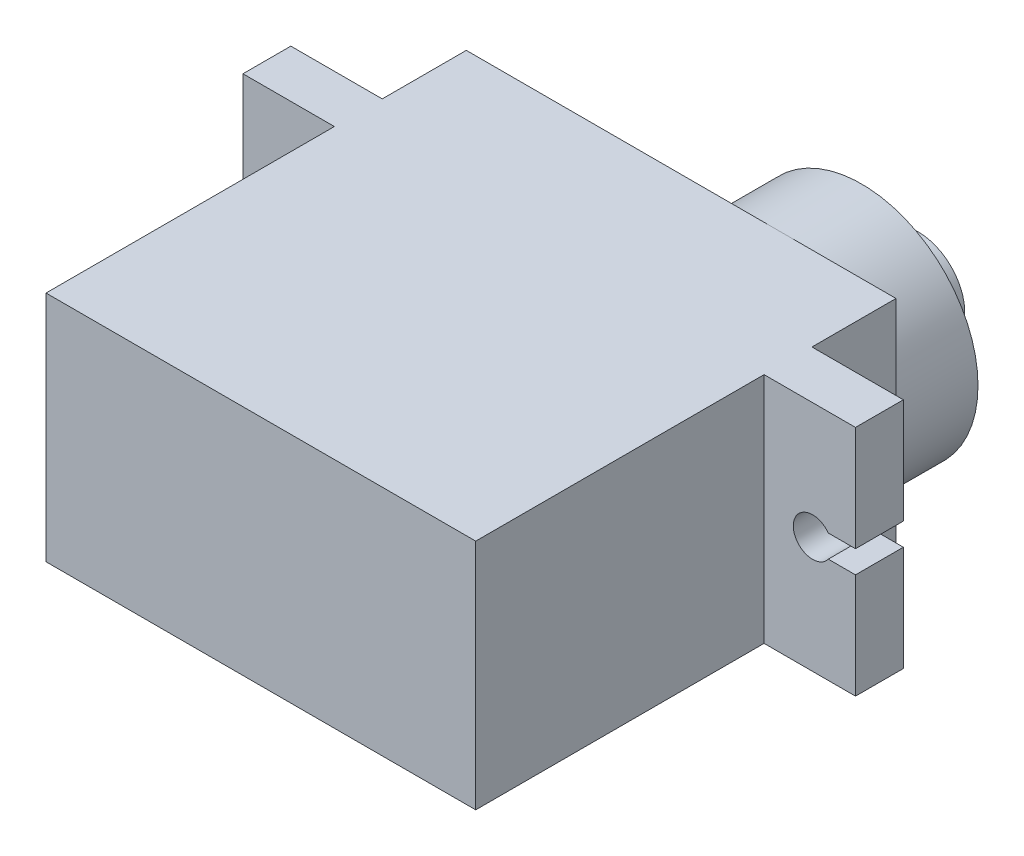
ISO-10303-21;
HEADER;
FILE_DESCRIPTION(('STEP AP214'),'2;1');
FILE_NAME('part.step','',(''),(''),'','','');
FILE_SCHEMA(('AUTOMOTIVE_DESIGN { 1 0 10303 214 1 1 1 1 }'));
ENDSEC;
DATA;
#1=APPLICATION_CONTEXT('core data for automotive mechanical design processes');
#2=APPLICATION_PROTOCOL_DEFINITION('international standard','automotive_design',2000,#1);
#3=PRODUCT_CONTEXT('',#1,'mechanical');
#4=PRODUCT('Part','Part','',(#3));
#5=PRODUCT_RELATED_PRODUCT_CATEGORY('part','',(#4));
#6=PRODUCT_DEFINITION_FORMATION('','',#4);
#7=PRODUCT_DEFINITION_CONTEXT('part definition',#1,'design');
#8=PRODUCT_DEFINITION('design','',#6,#7);
#9=PRODUCT_DEFINITION_SHAPE('','',#8);
#10=(LENGTH_UNIT() NAMED_UNIT(*) SI_UNIT(.MILLI.,.METRE.));
#11=(NAMED_UNIT(*) PLANE_ANGLE_UNIT() SI_UNIT($,.RADIAN.));
#12=(NAMED_UNIT(*) SI_UNIT($,.STERADIAN.) SOLID_ANGLE_UNIT());
#13=UNCERTAINTY_MEASURE_WITH_UNIT(LENGTH_MEASURE(1.E-05),#10,'distance_accuracy_value','');
#14=(GEOMETRIC_REPRESENTATION_CONTEXT(3) GLOBAL_UNCERTAINTY_ASSIGNED_CONTEXT((#13)) GLOBAL_UNIT_ASSIGNED_CONTEXT((#10,
#11,#12)) REPRESENTATION_CONTEXT('',''));
#15=CARTESIAN_POINT('',(0.,0.,0.));
#16=DIRECTION('',(0.,0.,1.));
#17=DIRECTION('',(1.,0.,0.));
#18=AXIS2_PLACEMENT_3D('',#15,#16,#17);
#19=CARTESIAN_POINT('',(11.4,6.175,-11.15));
#20=DIRECTION('',(0.,0.,1.));
#21=DIRECTION('',(1.,0.,0.));
#22=AXIS2_PLACEMENT_3D('',#19,#20,#21);
#23=PLANE('',#22);
#24=CARTESIAN_POINT('',(5.225,0.,-11.15));
#25=DIRECTION('',(0.,0.,-1.));
#26=DIRECTION('',(-1.,0.,0.));
#27=AXIS2_PLACEMENT_3D('',#24,#25,#26);
#28=CIRCLE('',#27,6.175);
#29=CARTESIAN_POINT('',(5.225,6.175,-11.15));
#30=VERTEX_POINT('',#29);
#31=CARTESIAN_POINT('',(11.4,0.,-11.15));
#32=VERTEX_POINT('',#31);
#33=EDGE_CURVE('E210',#30,#32,#28,.T.);
#34=ORIENTED_EDGE('',*,*,#33,.F.);
#35=DIRECTION('',(-1.,0.,0.));
#36=VECTOR('',#35,1.);
#37=CARTESIAN_POINT('',(11.4,6.175,-11.15));
#38=LINE('',#37,#36);
#39=CARTESIAN_POINT('',(11.4,6.175,-11.15));
#40=VERTEX_POINT('',#39);
#41=EDGE_CURVE('E192',#40,#30,#38,.T.);
#42=ORIENTED_EDGE('',*,*,#41,.F.);
#43=DIRECTION('',(0.,-1.,0.));
#44=VECTOR('',#43,1.);
#45=CARTESIAN_POINT('',(11.4,6.175,-11.15));
#46=LINE('',#45,#44);
#47=EDGE_CURVE('E211',#40,#32,#46,.T.);
#48=ORIENTED_EDGE('',*,*,#47,.T.);
#49=EDGE_LOOP('',(#34,#42,#48));
#50=FACE_BOUND('',#49,.T.);
#51=ADVANCED_FACE('F44',(#50),#23,.F.);
#52=CARTESIAN_POINT('',(5.225,-6.175,-11.15));
#53=VERTEX_POINT('',#52);
#54=EDGE_CURVE('E53',#32,#53,#28,.T.);
#55=ORIENTED_EDGE('',*,*,#54,.F.);
#56=CARTESIAN_POINT('',(11.4,-6.175,-11.15));
#57=VERTEX_POINT('',#56);
#58=EDGE_CURVE('E336',#32,#57,#46,.T.);
#59=ORIENTED_EDGE('',*,*,#58,.T.);
#60=DIRECTION('',(-1.,0.,0.));
#61=VECTOR('',#60,1.);
#62=CARTESIAN_POINT('',(11.4,-6.175,-11.15));
#63=LINE('',#62,#61);
#64=EDGE_CURVE('E333',#57,#53,#63,.T.);
#65=ORIENTED_EDGE('',*,*,#64,.T.);
#66=EDGE_LOOP('',(#55,#59,#65));
#67=FACE_BOUND('',#66,.T.);
#68=ADVANCED_FACE('F392',(#67),#23,.F.);
#69=CARTESIAN_POINT('',(16.25,0.,0.));
#70=DIRECTION('',(1.,0.,0.));
#71=DIRECTION('',(0.,0.,-1.));
#72=AXIS2_PLACEMENT_3D('',#69,#70,#71);
#73=PLANE('',#72);
#74=DIRECTION('',(0.,0.,-1.));
#75=VECTOR('',#74,1.);
#76=CARTESIAN_POINT('',(16.25,-0.6,0.));
#77=LINE('',#76,#75);
#78=CARTESIAN_POINT('',(16.25,-0.6,-4.15000000000001));
#79=VERTEX_POINT('',#78);
#80=CARTESIAN_POINT('',(16.25,-0.6,-6.69000000000001));
#81=VERTEX_POINT('',#80);
#82=EDGE_CURVE('E48',#79,#81,#77,.T.);
#83=ORIENTED_EDGE('',*,*,#82,.F.);
#84=DIRECTION('',(0.,-1.,0.));
#85=VECTOR('',#84,1.);
#86=CARTESIAN_POINT('',(16.25,6.175,-4.15000000000001));
#87=LINE('',#86,#85);
#88=CARTESIAN_POINT('',(16.25,-6.175,-4.15000000000001));
#89=VERTEX_POINT('',#88);
#90=EDGE_CURVE('E292',#79,#89,#87,.T.);
#91=ORIENTED_EDGE('',*,*,#90,.T.);
#92=DIRECTION('',(0.,0.,-1.));
#93=VECTOR('',#92,1.);
#94=CARTESIAN_POINT('',(16.25,-6.175,-4.15000000000001));
#95=LINE('',#94,#93);
#96=CARTESIAN_POINT('',(16.25,-6.175,-6.69000000000001));
#97=VERTEX_POINT('',#96);
#98=EDGE_CURVE('E291',#89,#97,#95,.T.);
#99=ORIENTED_EDGE('',*,*,#98,.T.);
#100=DIRECTION('',(0.,1.,0.));
#101=VECTOR('',#100,1.);
#102=CARTESIAN_POINT('',(16.25,6.175,-6.69000000000001));
#103=LINE('',#102,#101);
#104=EDGE_CURVE('E295',#97,#81,#103,.T.);
#105=ORIENTED_EDGE('',*,*,#104,.T.);
#106=EDGE_LOOP('',(#83,#91,#99,#105));
#107=FACE_BOUND('',#106,.T.);
#108=ADVANCED_FACE('F378',(#107),#73,.T.);
#109=CARTESIAN_POINT('',(-16.25,0.,0.));
#110=DIRECTION('',(-1.,0.,0.));
#111=DIRECTION('',(0.,0.,-1.));
#112=AXIS2_PLACEMENT_3D('',#109,#110,#111);
#113=PLANE('',#112);
#114=DIRECTION('',(0.,0.,-1.));
#115=VECTOR('',#114,1.);
#116=CARTESIAN_POINT('',(-16.25,0.6,0.));
#117=LINE('',#116,#115);
#118=CARTESIAN_POINT('',(-16.25,0.6,-4.15000000000001));
#119=VERTEX_POINT('',#118);
#120=CARTESIAN_POINT('',(-16.25,0.6,-6.69));
#121=VERTEX_POINT('',#120);
#122=EDGE_CURVE('E346',#119,#121,#117,.T.);
#123=ORIENTED_EDGE('',*,*,#122,.F.);
#124=DIRECTION('',(0.,-1.,0.));
#125=VECTOR('',#124,1.);
#126=CARTESIAN_POINT('',(-16.25,6.175,-4.15000000000001));
#127=LINE('',#126,#125);
#128=CARTESIAN_POINT('',(-16.25,6.175,-4.15000000000001));
#129=VERTEX_POINT('',#128);
#130=EDGE_CURVE('E260',#129,#119,#127,.T.);
#131=ORIENTED_EDGE('',*,*,#130,.F.);
#132=DIRECTION('',(0.,0.,1.));
#133=VECTOR('',#132,1.);
#134=CARTESIAN_POINT('',(-16.25,6.175,-4.15000000000001));
#135=LINE('',#134,#133);
#136=CARTESIAN_POINT('',(-16.25,6.175,-6.69000000000001));
#137=VERTEX_POINT('',#136);
#138=EDGE_CURVE('E263',#137,#129,#135,.T.);
#139=ORIENTED_EDGE('',*,*,#138,.F.);
#140=DIRECTION('',(0.,1.,0.));
#141=VECTOR('',#140,1.);
#142=CARTESIAN_POINT('',(-16.25,6.175,-6.69000000000001));
#143=LINE('',#142,#141);
#144=EDGE_CURVE('E267',#121,#137,#143,.T.);
#145=ORIENTED_EDGE('',*,*,#144,.F.);
#146=EDGE_LOOP('',(#123,#131,#139,#145));
#147=FACE_BOUND('',#146,.T.);
#148=ADVANCED_FACE('F399',(#147),#113,.T.);
#149=CARTESIAN_POINT('',(-11.4,6.175,-11.15));
#150=DIRECTION('',(1.,0.,0.));
#151=DIRECTION('',(0.,0.,-1.));
#152=AXIS2_PLACEMENT_3D('',#149,#150,#151);
#153=PLANE('',#152);
#154=DIRECTION('',(0.,0.,1.));
#155=VECTOR('',#154,1.);
#156=CARTESIAN_POINT('',(-11.4,6.175,-11.15));
#157=LINE('',#156,#155);
#158=CARTESIAN_POINT('',(-11.4,6.175,-4.15000000000001));
#159=VERTEX_POINT('',#158);
#160=CARTESIAN_POINT('',(-11.4,6.175,11.15));
#161=VERTEX_POINT('',#160);
#162=EDGE_CURVE('E320',#159,#161,#157,.T.);
#163=ORIENTED_EDGE('',*,*,#162,.F.);
#164=DIRECTION('',(0.,-1.,0.));
#165=VECTOR('',#164,1.);
#166=CARTESIAN_POINT('',(-11.4,6.175,-4.15000000000001));
#167=LINE('',#166,#165);
#168=CARTESIAN_POINT('',(-11.4,-6.175,-4.15000000000001));
#169=VERTEX_POINT('',#168);
#170=EDGE_CURVE('E259',#159,#169,#167,.T.);
#171=ORIENTED_EDGE('',*,*,#170,.T.);
#172=DIRECTION('',(0.,0.,1.));
#173=VECTOR('',#172,1.);
#174=CARTESIAN_POINT('',(-11.4,-6.175,-11.15));
#175=LINE('',#174,#173);
#176=CARTESIAN_POINT('',(-11.4,-6.175,11.15));
#177=VERTEX_POINT('',#176);
#178=EDGE_CURVE('E316',#169,#177,#175,.T.);
#179=ORIENTED_EDGE('',*,*,#178,.T.);
#180=DIRECTION('',(0.,-1.,0.));
#181=VECTOR('',#180,1.);
#182=CARTESIAN_POINT('',(-11.4,6.175,11.15));
#183=LINE('',#182,#181);
#184=EDGE_CURVE('E341',#161,#177,#183,.T.);
#185=ORIENTED_EDGE('',*,*,#184,.F.);
#186=EDGE_LOOP('',(#163,#171,#179,#185));
#187=FACE_BOUND('',#186,.T.);
#188=ADVANCED_FACE('F415',(#187),#153,.F.);
#189=CARTESIAN_POINT('',(11.4,6.175,-11.15));
#190=DIRECTION('',(-1.,0.,0.));
#191=DIRECTION('',(0.,0.,1.));
#192=AXIS2_PLACEMENT_3D('',#189,#190,#191);
#193=PLANE('',#192);
#194=DIRECTION('',(0.,-1.,0.));
#195=VECTOR('',#194,1.);
#196=CARTESIAN_POINT('',(11.4,6.175,-4.15000000000001));
#197=LINE('',#196,#195);
#198=CARTESIAN_POINT('',(11.4,6.175,-4.15000000000001));
#199=VERTEX_POINT('',#198);
#200=CARTESIAN_POINT('',(11.4,-6.175,-4.15000000000001));
#201=VERTEX_POINT('',#200);
#202=EDGE_CURVE('E287',#199,#201,#197,.T.);
#203=ORIENTED_EDGE('',*,*,#202,.F.);
#204=DIRECTION('',(0.,0.,-1.));
#205=VECTOR('',#204,1.);
#206=CARTESIAN_POINT('',(11.4,6.175,-11.15));
#207=LINE('',#206,#205);
#208=CARTESIAN_POINT('',(11.4,6.175,11.15));
#209=VERTEX_POINT('',#208);
#210=EDGE_CURVE('E208',#209,#199,#207,.T.);
#211=ORIENTED_EDGE('',*,*,#210,.F.);
#212=DIRECTION('',(0.,-1.,0.));
#213=VECTOR('',#212,1.);
#214=CARTESIAN_POINT('',(11.4,6.175,11.15));
#215=LINE('',#214,#213);
#216=CARTESIAN_POINT('',(11.4,-6.175,11.15));
#217=VERTEX_POINT('',#216);
#218=EDGE_CURVE('E338',#209,#217,#215,.T.);
#219=ORIENTED_EDGE('',*,*,#218,.T.);
#220=DIRECTION('',(0.,0.,-1.));
#221=VECTOR('',#220,1.);
#222=CARTESIAN_POINT('',(11.4,-6.175,-11.15));
#223=LINE('',#222,#221);
#224=EDGE_CURVE('E330',#217,#201,#223,.T.);
#225=ORIENTED_EDGE('',*,*,#224,.T.);
#226=EDGE_LOOP('',(#203,#211,#219,#225));
#227=FACE_BOUND('',#226,.T.);
#228=ADVANCED_FACE('F365',(#227),#193,.F.);
#229=DIRECTION('',(0.,1.,0.));
#230=VECTOR('',#229,1.);
#231=CARTESIAN_POINT('',(11.4,6.175,-6.69000000000001));
#232=LINE('',#231,#230);
#233=CARTESIAN_POINT('',(11.4,-6.175,-6.69000000000001));
#234=VERTEX_POINT('',#233);
#235=CARTESIAN_POINT('',(11.4,6.175,-6.69000000000001));
#236=VERTEX_POINT('',#235);
#237=EDGE_CURVE('E303',#234,#236,#232,.T.);
#238=ORIENTED_EDGE('',*,*,#237,.F.);
#239=EDGE_CURVE('E329',#234,#57,#223,.T.);
#240=ORIENTED_EDGE('',*,*,#239,.T.);
#241=ORIENTED_EDGE('',*,*,#58,.F.);
#242=ORIENTED_EDGE('',*,*,#47,.F.);
#243=EDGE_CURVE('E198',#236,#40,#207,.T.);
#244=ORIENTED_EDGE('',*,*,#243,.F.);
#245=EDGE_LOOP('',(#238,#240,#241,#242,#244));
#246=FACE_BOUND('',#245,.T.);
#247=ADVANCED_FACE('F390',(#246),#193,.F.);
#248=CARTESIAN_POINT('',(-11.4,-6.175,-11.15));
#249=VERTEX_POINT('',#248);
#250=CARTESIAN_POINT('',(-11.4,-6.175,-6.69000000000001));
#251=VERTEX_POINT('',#250);
#252=EDGE_CURVE('E324',#249,#251,#175,.T.);
#253=ORIENTED_EDGE('',*,*,#252,.T.);
#254=DIRECTION('',(0.,1.,0.));
#255=VECTOR('',#254,1.);
#256=CARTESIAN_POINT('',(-11.4,6.175,-6.69000000000001));
#257=LINE('',#256,#255);
#258=CARTESIAN_POINT('',(-11.4,6.175,-6.69000000000001));
#259=VERTEX_POINT('',#258);
#260=EDGE_CURVE('E277',#251,#259,#257,.T.);
#261=ORIENTED_EDGE('',*,*,#260,.T.);
#262=CARTESIAN_POINT('',(-11.4,6.175,-11.15));
#263=VERTEX_POINT('',#262);
#264=EDGE_CURVE('E317',#263,#259,#157,.T.);
#265=ORIENTED_EDGE('',*,*,#264,.F.);
#266=DIRECTION('',(0.,-1.,0.));
#267=VECTOR('',#266,1.);
#268=CARTESIAN_POINT('',(-11.4,6.175,-11.15));
#269=LINE('',#268,#267);
#270=EDGE_CURVE('E203',#263,#249,#269,.T.);
#271=ORIENTED_EDGE('',*,*,#270,.T.);
#272=EDGE_LOOP('',(#253,#261,#265,#271));
#273=FACE_BOUND('',#272,.T.);
#274=ADVANCED_FACE('F46',(#273),#153,.F.);
#275=CARTESIAN_POINT('',(11.4,6.175,11.15));
#276=DIRECTION('',(0.,0.,-1.));
#277=DIRECTION('',(-1.,0.,0.));
#278=AXIS2_PLACEMENT_3D('',#275,#276,#277);
#279=PLANE('',#278);
#280=DIRECTION('',(1.,0.,0.));
#281=VECTOR('',#280,1.);
#282=CARTESIAN_POINT('',(11.4,-6.175,11.15));
#283=LINE('',#282,#281);
#284=EDGE_CURVE('E327',#177,#217,#283,.T.);
#285=ORIENTED_EDGE('',*,*,#284,.T.);
#286=ORIENTED_EDGE('',*,*,#218,.F.);
#287=DIRECTION('',(1.,0.,0.));
#288=VECTOR('',#287,1.);
#289=CARTESIAN_POINT('',(11.4,6.175,11.15));
#290=LINE('',#289,#288);
#291=EDGE_CURVE('E319',#161,#209,#290,.T.);
#292=ORIENTED_EDGE('',*,*,#291,.F.);
#293=ORIENTED_EDGE('',*,*,#184,.T.);
#294=EDGE_LOOP('',(#285,#286,#292,#293));
#295=FACE_BOUND('',#294,.T.);
#296=ADVANCED_FACE('F404',(#295),#279,.F.);
#297=EDGE_CURVE('E68',#53,#30,#28,.T.);
#298=ORIENTED_EDGE('',*,*,#297,.F.);
#299=EDGE_CURVE('E332',#53,#249,#63,.T.);
#300=ORIENTED_EDGE('',*,*,#299,.T.);
#301=ORIENTED_EDGE('',*,*,#270,.F.);
#302=EDGE_CURVE('E195',#30,#263,#38,.T.);
#303=ORIENTED_EDGE('',*,*,#302,.F.);
#304=EDGE_LOOP('',(#298,#300,#301,#303));
#305=FACE_BOUND('',#304,.T.);
#306=ADVANCED_FACE('F205',(#305),#23,.F.);
#307=CARTESIAN_POINT('',(0.,6.175,0.));
#308=DIRECTION('',(0.,-1.,0.));
#309=DIRECTION('',(0.,0.,-1.));
#310=AXIS2_PLACEMENT_3D('',#307,#308,#309);
#311=PLANE('',#310);
#312=ORIENTED_EDGE('',*,*,#264,.T.);
#313=DIRECTION('',(1.,0.,0.));
#314=VECTOR('',#313,1.);
#315=CARTESIAN_POINT('',(-16.25,6.175,-6.69000000000001));
#316=LINE('',#315,#314);
#317=EDGE_CURVE('E283',#137,#259,#316,.T.);
#318=ORIENTED_EDGE('',*,*,#317,.F.);
#319=ORIENTED_EDGE('',*,*,#138,.T.);
#320=DIRECTION('',(1.,0.,0.));
#321=VECTOR('',#320,1.);
#322=CARTESIAN_POINT('',(-16.25,6.175,-4.15000000000001));
#323=LINE('',#322,#321);
#324=EDGE_CURVE('E285',#129,#159,#323,.T.);
#325=ORIENTED_EDGE('',*,*,#324,.T.);
#326=ORIENTED_EDGE('',*,*,#162,.T.);
#327=ORIENTED_EDGE('',*,*,#291,.T.);
#328=ORIENTED_EDGE('',*,*,#210,.T.);
#329=DIRECTION('',(-1.,0.,0.));
#330=VECTOR('',#329,1.);
#331=CARTESIAN_POINT('',(16.25,6.175,-4.15000000000001));
#332=LINE('',#331,#330);
#333=CARTESIAN_POINT('',(16.25,6.175,-4.15000000000001));
#334=VERTEX_POINT('',#333);
#335=EDGE_CURVE('E300',#334,#199,#332,.T.);
#336=ORIENTED_EDGE('',*,*,#335,.F.);
#337=DIRECTION('',(0.,0.,1.));
#338=VECTOR('',#337,1.);
#339=CARTESIAN_POINT('',(16.25,6.175,-4.15000000000001));
#340=LINE('',#339,#338);
#341=CARTESIAN_POINT('',(16.25,6.175,-6.69000000000001));
#342=VERTEX_POINT('',#341);
#343=EDGE_CURVE('E298',#342,#334,#340,.T.);
#344=ORIENTED_EDGE('',*,*,#343,.F.);
#345=DIRECTION('',(-1.,0.,0.));
#346=VECTOR('',#345,1.);
#347=CARTESIAN_POINT('',(16.25,6.175,-6.69000000000001));
#348=LINE('',#347,#346);
#349=EDGE_CURVE('E308',#342,#236,#348,.T.);
#350=ORIENTED_EDGE('',*,*,#349,.T.);
#351=ORIENTED_EDGE('',*,*,#243,.T.);
#352=ORIENTED_EDGE('',*,*,#41,.T.);
#353=ORIENTED_EDGE('',*,*,#302,.T.);
#354=EDGE_LOOP('',(#312,#318,#319,#325,#326,#327,#328,#336,#344,#350,#351,#352,#353));
#355=FACE_BOUND('',#354,.T.);
#356=ADVANCED_FACE('F194',(#355),#311,.F.);
#357=CARTESIAN_POINT('',(0.,-6.175,0.));
#358=DIRECTION('',(0.,-1.,0.));
#359=DIRECTION('',(0.,0.,-1.));
#360=AXIS2_PLACEMENT_3D('',#357,#358,#359);
#361=PLANE('',#360);
#362=ORIENTED_EDGE('',*,*,#252,.F.);
#363=ORIENTED_EDGE('',*,*,#299,.F.);
#364=ORIENTED_EDGE('',*,*,#64,.F.);
#365=ORIENTED_EDGE('',*,*,#239,.F.);
#366=DIRECTION('',(-1.,0.,0.));
#367=VECTOR('',#366,1.);
#368=CARTESIAN_POINT('',(16.25,-6.175,-6.69000000000001));
#369=LINE('',#368,#367);
#370=EDGE_CURVE('E310',#97,#234,#369,.T.);
#371=ORIENTED_EDGE('',*,*,#370,.F.);
#372=ORIENTED_EDGE('',*,*,#98,.F.);
#373=DIRECTION('',(-1.,0.,0.));
#374=VECTOR('',#373,1.);
#375=CARTESIAN_POINT('',(16.25,-6.175,-4.15000000000001));
#376=LINE('',#375,#374);
#377=EDGE_CURVE('E313',#89,#201,#376,.T.);
#378=ORIENTED_EDGE('',*,*,#377,.T.);
#379=ORIENTED_EDGE('',*,*,#224,.F.);
#380=ORIENTED_EDGE('',*,*,#284,.F.);
#381=ORIENTED_EDGE('',*,*,#178,.F.);
#382=DIRECTION('',(1.,0.,0.));
#383=VECTOR('',#382,1.);
#384=CARTESIAN_POINT('',(-16.25,-6.175,-4.15000000000001));
#385=LINE('',#384,#383);
#386=CARTESIAN_POINT('',(-16.25,-6.175,-4.15000000000001));
#387=VERTEX_POINT('',#386);
#388=EDGE_CURVE('E274',#387,#169,#385,.T.);
#389=ORIENTED_EDGE('',*,*,#388,.F.);
#390=DIRECTION('',(0.,0.,-1.));
#391=VECTOR('',#390,1.);
#392=CARTESIAN_POINT('',(-16.25,-6.175,-4.15000000000001));
#393=LINE('',#392,#391);
#394=CARTESIAN_POINT('',(-16.25,-6.175,-6.69000000000001));
#395=VERTEX_POINT('',#394);
#396=EDGE_CURVE('E271',#387,#395,#393,.T.);
#397=ORIENTED_EDGE('',*,*,#396,.T.);
#398=DIRECTION('',(1.,0.,0.));
#399=VECTOR('',#398,1.);
#400=CARTESIAN_POINT('',(-16.25,-6.175,-6.69000000000001));
#401=LINE('',#400,#399);
#402=EDGE_CURVE('E281',#395,#251,#401,.T.);
#403=ORIENTED_EDGE('',*,*,#402,.T.);
#404=EDGE_LOOP('',(#362,#363,#364,#365,#371,#372,#378,#379,#380,#381,#389,#397,#403));
#405=FACE_BOUND('',#404,.T.);
#406=ADVANCED_FACE('F372',(#405),#361,.T.);
#407=CARTESIAN_POINT('',(16.25,6.175,-4.15000000000001));
#408=DIRECTION('',(0.,0.,-1.));
#409=DIRECTION('',(-1.,0.,0.));
#410=AXIS2_PLACEMENT_3D('',#407,#408,#409);
#411=PLANE('',#410);
#412=ORIENTED_EDGE('',*,*,#90,.F.);
#413=DIRECTION('',(-1.,0.,0.));
#414=VECTOR('',#413,1.);
#415=CARTESIAN_POINT('',(16.25,-0.6,-4.15000000000001));
#416=LINE('',#415,#414);
#417=CARTESIAN_POINT('',(14.8060385069297,-0.6,-4.15000000000001));
#418=VERTEX_POINT('',#417);
#419=EDGE_CURVE('E253',#79,#418,#416,.T.);
#420=ORIENTED_EDGE('',*,*,#419,.T.);
#421=CARTESIAN_POINT('',(13.975,0.,-4.15000000000001));
#422=DIRECTION('',(0.,0.,-1.));
#423=DIRECTION('',(-1.,0.,0.));
#424=AXIS2_PLACEMENT_3D('',#421,#422,#423);
#425=CIRCLE('',#424,1.025);
#426=CARTESIAN_POINT('',(14.8060385069297,0.6,-4.15000000000001));
#427=VERTEX_POINT('',#426);
#428=EDGE_CURVE('E256',#418,#427,#425,.T.);
#429=ORIENTED_EDGE('',*,*,#428,.T.);
#430=DIRECTION('',(1.,0.,0.));
#431=VECTOR('',#430,1.);
#432=CARTESIAN_POINT('',(16.25,0.6,-4.15000000000001));
#433=LINE('',#432,#431);
#434=CARTESIAN_POINT('',(16.25,0.6,-4.15000000000001));
#435=VERTEX_POINT('',#434);
#436=EDGE_CURVE('E250',#427,#435,#433,.T.);
#437=ORIENTED_EDGE('',*,*,#436,.T.);
#438=EDGE_CURVE('E288',#334,#435,#87,.T.);
#439=ORIENTED_EDGE('',*,*,#438,.F.);
#440=ORIENTED_EDGE('',*,*,#335,.T.);
#441=ORIENTED_EDGE('',*,*,#202,.T.);
#442=ORIENTED_EDGE('',*,*,#377,.F.);
#443=EDGE_LOOP('',(#412,#420,#429,#437,#439,#440,#441,#442));
#444=FACE_BOUND('',#443,.T.);
#445=ADVANCED_FACE('F357',(#444),#411,.F.);
#446=CARTESIAN_POINT('',(16.25,6.175,-6.69000000000001));
#447=DIRECTION('',(0.,0.,1.));
#448=DIRECTION('',(1.,0.,0.));
#449=AXIS2_PLACEMENT_3D('',#446,#447,#448);
#450=PLANE('',#449);
#451=CARTESIAN_POINT('',(13.975,0.,-6.69000000000001));
#452=DIRECTION('',(0.,0.,-1.));
#453=DIRECTION('',(-1.,0.,0.));
#454=AXIS2_PLACEMENT_3D('',#451,#452,#453);
#455=CIRCLE('',#454,1.025);
#456=CARTESIAN_POINT('',(14.8060385069297,-0.6,-6.69000000000001));
#457=VERTEX_POINT('',#456);
#458=CARTESIAN_POINT('',(14.8060385069297,0.6,-6.69000000000001));
#459=VERTEX_POINT('',#458);
#460=EDGE_CURVE('E224',#457,#459,#455,.T.);
#461=ORIENTED_EDGE('',*,*,#460,.F.);
#462=DIRECTION('',(-1.,0.,0.));
#463=VECTOR('',#462,1.);
#464=CARTESIAN_POINT('',(16.25,-0.6,-6.69000000000001));
#465=LINE('',#464,#463);
#466=EDGE_CURVE('E236',#81,#457,#465,.T.);
#467=ORIENTED_EDGE('',*,*,#466,.F.);
#468=ORIENTED_EDGE('',*,*,#104,.F.);
#469=ORIENTED_EDGE('',*,*,#370,.T.);
#470=ORIENTED_EDGE('',*,*,#237,.T.);
#471=ORIENTED_EDGE('',*,*,#349,.F.);
#472=CARTESIAN_POINT('',(16.25,0.6,-6.69000000000001));
#473=VERTEX_POINT('',#472);
#474=EDGE_CURVE('E294',#473,#342,#103,.T.);
#475=ORIENTED_EDGE('',*,*,#474,.F.);
#476=DIRECTION('',(1.,0.,0.));
#477=VECTOR('',#476,1.);
#478=CARTESIAN_POINT('',(14.8060385069297,0.6,-6.69000000000001));
#479=LINE('',#478,#477);
#480=EDGE_CURVE('E241',#459,#473,#479,.T.);
#481=ORIENTED_EDGE('',*,*,#480,.F.);
#482=EDGE_LOOP('',(#461,#467,#468,#469,#470,#471,#475,#481));
#483=FACE_BOUND('',#482,.T.);
#484=ADVANCED_FACE('F387',(#483),#450,.F.);
#485=DIRECTION('',(0.,0.,1.));
#486=VECTOR('',#485,1.);
#487=CARTESIAN_POINT('',(16.25,0.6,0.));
#488=LINE('',#487,#486);
#489=EDGE_CURVE('E217',#473,#435,#488,.T.);
#490=ORIENTED_EDGE('',*,*,#489,.F.);
#491=ORIENTED_EDGE('',*,*,#474,.T.);
#492=ORIENTED_EDGE('',*,*,#343,.T.);
#493=ORIENTED_EDGE('',*,*,#438,.T.);
#494=EDGE_LOOP('',(#490,#491,#492,#493));
#495=FACE_BOUND('',#494,.T.);
#496=ADVANCED_FACE('F358',(#495),#73,.T.);
#497=CARTESIAN_POINT('',(-16.25,6.175,-4.15000000000001));
#498=DIRECTION('',(0.,0.,1.));
#499=DIRECTION('',(1.,0.,0.));
#500=AXIS2_PLACEMENT_3D('',#497,#498,#499);
#501=PLANE('',#500);
#502=DIRECTION('',(-1.,0.,0.));
#503=VECTOR('',#502,1.);
#504=CARTESIAN_POINT('',(-16.25,0.6,-4.15000000000001));
#505=LINE('',#504,#503);
#506=CARTESIAN_POINT('',(-14.8060385069297,0.6,-4.15000000000001));
#507=VERTEX_POINT('',#506);
#508=EDGE_CURVE('E246',#507,#119,#505,.T.);
#509=ORIENTED_EDGE('',*,*,#508,.F.);
#510=CARTESIAN_POINT('',(-13.975,0.,-4.15000000000001));
#511=DIRECTION('',(0.,0.,1.));
#512=DIRECTION('',(1.,0.,0.));
#513=AXIS2_PLACEMENT_3D('',#510,#511,#512);
#514=CIRCLE('',#513,1.025);
#515=CARTESIAN_POINT('',(-14.8060385069297,-0.599999999999996,-4.15000000000001));
#516=VERTEX_POINT('',#515);
#517=EDGE_CURVE('E248',#516,#507,#514,.T.);
#518=ORIENTED_EDGE('',*,*,#517,.F.);
#519=DIRECTION('',(1.,0.,0.));
#520=VECTOR('',#519,1.);
#521=CARTESIAN_POINT('',(-16.25,-0.600000000000002,-4.15000000000001));
#522=LINE('',#521,#520);
#523=CARTESIAN_POINT('',(-16.25,-0.600000000000002,-4.15000000000001));
#524=VERTEX_POINT('',#523);
#525=EDGE_CURVE('E232',#524,#516,#522,.T.);
#526=ORIENTED_EDGE('',*,*,#525,.F.);
#527=EDGE_CURVE('E264',#524,#387,#127,.T.);
#528=ORIENTED_EDGE('',*,*,#527,.T.);
#529=ORIENTED_EDGE('',*,*,#388,.T.);
#530=ORIENTED_EDGE('',*,*,#170,.F.);
#531=ORIENTED_EDGE('',*,*,#324,.F.);
#532=ORIENTED_EDGE('',*,*,#130,.T.);
#533=EDGE_LOOP('',(#509,#518,#526,#528,#529,#530,#531,#532));
#534=FACE_BOUND('',#533,.T.);
#535=ADVANCED_FACE('F452',(#534),#501,.T.);
#536=CARTESIAN_POINT('',(-16.25,6.175,-6.69000000000001));
#537=DIRECTION('',(0.,0.,-1.));
#538=DIRECTION('',(-1.,0.,0.));
#539=AXIS2_PLACEMENT_3D('',#536,#537,#538);
#540=PLANE('',#539);
#541=DIRECTION('',(1.,0.,0.));
#542=VECTOR('',#541,1.);
#543=CARTESIAN_POINT('',(-14.8060385069297,0.6,-6.69));
#544=LINE('',#543,#542);
#545=CARTESIAN_POINT('',(-14.8060385069297,0.6,-6.69));
#546=VERTEX_POINT('',#545);
#547=EDGE_CURVE('E226',#121,#546,#544,.T.);
#548=ORIENTED_EDGE('',*,*,#547,.F.);
#549=ORIENTED_EDGE('',*,*,#144,.T.);
#550=ORIENTED_EDGE('',*,*,#317,.T.);
#551=ORIENTED_EDGE('',*,*,#260,.F.);
#552=ORIENTED_EDGE('',*,*,#402,.F.);
#553=CARTESIAN_POINT('',(-16.25,-0.599999999999999,-6.69000000000001));
#554=VERTEX_POINT('',#553);
#555=EDGE_CURVE('E268',#395,#554,#143,.T.);
#556=ORIENTED_EDGE('',*,*,#555,.T.);
#557=DIRECTION('',(-1.,0.,0.));
#558=VECTOR('',#557,1.);
#559=CARTESIAN_POINT('',(-16.25,-0.600000000000002,-6.69));
#560=LINE('',#559,#558);
#561=CARTESIAN_POINT('',(-14.8060385069297,-0.599999999999996,-6.69));
#562=VERTEX_POINT('',#561);
#563=EDGE_CURVE('E223',#562,#554,#560,.T.);
#564=ORIENTED_EDGE('',*,*,#563,.F.);
#565=CARTESIAN_POINT('',(-13.975,0.,-6.69));
#566=DIRECTION('',(0.,0.,-1.));
#567=DIRECTION('',(-1.,0.,0.));
#568=AXIS2_PLACEMENT_3D('',#565,#566,#567);
#569=CIRCLE('',#568,1.025);
#570=EDGE_CURVE('E220',#546,#562,#569,.T.);
#571=ORIENTED_EDGE('',*,*,#570,.F.);
#572=EDGE_LOOP('',(#548,#549,#550,#551,#552,#556,#564,#571));
#573=FACE_BOUND('',#572,.T.);
#574=ADVANCED_FACE('F443',(#573),#540,.T.);
#575=DIRECTION('',(0.,0.,1.));
#576=VECTOR('',#575,1.);
#577=CARTESIAN_POINT('',(-16.25,-0.600000000000002,0.));
#578=LINE('',#577,#576);
#579=EDGE_CURVE('E344',#554,#524,#578,.T.);
#580=ORIENTED_EDGE('',*,*,#579,.F.);
#581=ORIENTED_EDGE('',*,*,#555,.F.);
#582=ORIENTED_EDGE('',*,*,#396,.F.);
#583=ORIENTED_EDGE('',*,*,#527,.F.);
#584=EDGE_LOOP('',(#580,#581,#582,#583));
#585=FACE_BOUND('',#584,.T.);
#586=ADVANCED_FACE('F427',(#585),#113,.T.);
#587=CARTESIAN_POINT('',(-13.975,0.,11.15));
#588=DIRECTION('',(0.,0.,-1.));
#589=DIRECTION('',(-1.,0.,0.));
#590=AXIS2_PLACEMENT_3D('',#587,#588,#589);
#591=CYLINDRICAL_SURFACE('',#590,1.025);
#592=ORIENTED_EDGE('',*,*,#517,.T.);
#593=DIRECTION('',(0.,0.,-1.));
#594=VECTOR('',#593,1.);
#595=CARTESIAN_POINT('',(-14.8060385069297,0.6,11.15));
#596=LINE('',#595,#594);
#597=EDGE_CURVE('E230',#507,#546,#596,.T.);
#598=ORIENTED_EDGE('',*,*,#597,.T.);
#599=ORIENTED_EDGE('',*,*,#570,.T.);
#600=DIRECTION('',(0.,0.,-1.));
#601=VECTOR('',#600,1.);
#602=CARTESIAN_POINT('',(-14.8060385069297,-0.599999999999996,11.15));
#603=LINE('',#602,#601);
#604=EDGE_CURVE('E229',#516,#562,#603,.T.);
#605=ORIENTED_EDGE('',*,*,#604,.F.);
#606=EDGE_LOOP('',(#592,#598,#599,#605));
#607=FACE_BOUND('',#606,.T.);
#608=ADVANCED_FACE('F459',(#607),#591,.F.);
#609=CARTESIAN_POINT('',(-14.8060385069297,0.6,11.15));
#610=DIRECTION('',(0.,1.,0.));
#611=DIRECTION('',(-1.,0.,0.));
#612=AXIS2_PLACEMENT_3D('',#609,#610,#611);
#613=PLANE('',#612);
#614=ORIENTED_EDGE('',*,*,#508,.T.);
#615=ORIENTED_EDGE('',*,*,#122,.T.);
#616=ORIENTED_EDGE('',*,*,#547,.T.);
#617=ORIENTED_EDGE('',*,*,#597,.F.);
#618=EDGE_LOOP('',(#614,#615,#616,#617));
#619=FACE_BOUND('',#618,.T.);
#620=ADVANCED_FACE('F457',(#619),#613,.F.);
#621=CARTESIAN_POINT('',(-16.25,-0.600000000000002,11.15));
#622=DIRECTION('',(0.,-1.,0.));
#623=DIRECTION('',(1.,0.,0.));
#624=AXIS2_PLACEMENT_3D('',#621,#622,#623);
#625=PLANE('',#624);
#626=ORIENTED_EDGE('',*,*,#525,.T.);
#627=ORIENTED_EDGE('',*,*,#604,.T.);
#628=ORIENTED_EDGE('',*,*,#563,.T.);
#629=ORIENTED_EDGE('',*,*,#579,.T.);
#630=EDGE_LOOP('',(#626,#627,#628,#629));
#631=FACE_BOUND('',#630,.T.);
#632=ADVANCED_FACE('F462',(#631),#625,.F.);
#633=CARTESIAN_POINT('',(13.975,0.,11.15));
#634=DIRECTION('',(0.,0.,-1.));
#635=DIRECTION('',(-1.,0.,0.));
#636=AXIS2_PLACEMENT_3D('',#633,#634,#635);
#637=CYLINDRICAL_SURFACE('',#636,1.025);
#638=DIRECTION('',(0.,0.,-1.));
#639=VECTOR('',#638,1.);
#640=CARTESIAN_POINT('',(14.8060385069297,-0.6,11.15));
#641=LINE('',#640,#639);
#642=EDGE_CURVE('E237',#418,#457,#641,.T.);
#643=ORIENTED_EDGE('',*,*,#642,.T.);
#644=ORIENTED_EDGE('',*,*,#460,.T.);
#645=DIRECTION('',(0.,0.,-1.));
#646=VECTOR('',#645,1.);
#647=CARTESIAN_POINT('',(14.8060385069297,0.6,11.15));
#648=LINE('',#647,#646);
#649=EDGE_CURVE('E234',#427,#459,#648,.T.);
#650=ORIENTED_EDGE('',*,*,#649,.F.);
#651=ORIENTED_EDGE('',*,*,#428,.F.);
#652=EDGE_LOOP('',(#643,#644,#650,#651));
#653=FACE_BOUND('',#652,.T.);
#654=ADVANCED_FACE('F385',(#653),#637,.F.);
#655=CARTESIAN_POINT('',(16.25,-0.6,11.15));
#656=DIRECTION('',(0.,-1.,0.));
#657=DIRECTION('',(1.,0.,0.));
#658=AXIS2_PLACEMENT_3D('',#655,#656,#657);
#659=PLANE('',#658);
#660=ORIENTED_EDGE('',*,*,#82,.T.);
#661=ORIENTED_EDGE('',*,*,#466,.T.);
#662=ORIENTED_EDGE('',*,*,#642,.F.);
#663=ORIENTED_EDGE('',*,*,#419,.F.);
#664=EDGE_LOOP('',(#660,#661,#662,#663));
#665=FACE_BOUND('',#664,.T.);
#666=ADVANCED_FACE('F381',(#665),#659,.F.);
#667=CARTESIAN_POINT('',(14.8060385069297,0.6,11.15));
#668=DIRECTION('',(0.,1.,0.));
#669=DIRECTION('',(-1.,0.,0.));
#670=AXIS2_PLACEMENT_3D('',#667,#668,#669);
#671=PLANE('',#670);
#672=ORIENTED_EDGE('',*,*,#649,.T.);
#673=ORIENTED_EDGE('',*,*,#480,.T.);
#674=ORIENTED_EDGE('',*,*,#489,.T.);
#675=ORIENTED_EDGE('',*,*,#436,.F.);
#676=EDGE_LOOP('',(#672,#673,#674,#675));
#677=FACE_BOUND('',#676,.T.);
#678=ADVANCED_FACE('F349',(#677),#671,.F.);
#679=CARTESIAN_POINT('',(5.225,0.,-15.5));
#680=DIRECTION('',(0.,0.,1.));
#681=DIRECTION('',(1.,0.,0.));
#682=AXIS2_PLACEMENT_3D('',#679,#680,#681);
#683=CYLINDRICAL_SURFACE('',#682,6.175);
#684=CARTESIAN_POINT('',(5.225,0.,-15.5));
#685=DIRECTION('',(0.,0.,-1.));
#686=DIRECTION('',(-1.,0.,0.));
#687=AXIS2_PLACEMENT_3D('',#684,#685,#686);
#688=CIRCLE('',#687,6.175);
#689=CARTESIAN_POINT('',(-0.950000000000002,0.,-15.5));
#690=VERTEX_POINT('',#689);
#691=EDGE_CURVE('E213',#690,#690,#688,.T.);
#692=ORIENTED_EDGE('',*,*,#691,.F.);
#693=EDGE_LOOP('',(#692));
#694=FACE_BOUND('',#693,.T.);
#695=ORIENTED_EDGE('',*,*,#33,.T.);
#696=ORIENTED_EDGE('',*,*,#54,.T.);
#697=ORIENTED_EDGE('',*,*,#297,.T.);
#698=EDGE_LOOP('',(#695,#696,#697));
#699=FACE_BOUND('',#698,.T.);
#700=ADVANCED_FACE('F216',(#694,#699),#683,.T.);
#701=CARTESIAN_POINT('',(5.225,0.,-15.5));
#702=DIRECTION('',(0.,0.,-1.));
#703=DIRECTION('',(-1.,0.,0.));
#704=AXIS2_PLACEMENT_3D('',#701,#702,#703);
#705=PLANE('',#704);
#706=CARTESIAN_POINT('',(5.225,0.,-15.5));
#707=DIRECTION('',(0.,0.,-1.));
#708=DIRECTION('',(-1.,0.,0.));
#709=AXIS2_PLACEMENT_3D('',#706,#707,#708);
#710=CIRCLE('',#709,2.475);
#711=CARTESIAN_POINT('',(2.75,0.,-15.5));
#712=VERTEX_POINT('',#711);
#713=EDGE_CURVE('E11',#712,#712,#710,.T.);
#714=ORIENTED_EDGE('',*,*,#713,.F.);
#715=EDGE_LOOP('',(#714));
#716=FACE_BOUND('',#715,.T.);
#717=ORIENTED_EDGE('',*,*,#691,.T.);
#718=EDGE_LOOP('',(#717));
#719=FACE_BOUND('',#718,.T.);
#720=ADVANCED_FACE('F687',(#716,#719),#705,.T.);
#721=CARTESIAN_POINT('',(5.225,0.,-18.5));
#722=DIRECTION('',(0.,0.,1.));
#723=DIRECTION('',(1.,0.,0.));
#724=AXIS2_PLACEMENT_3D('',#721,#722,#723);
#725=CYLINDRICAL_SURFACE('',#724,2.475);
#726=CARTESIAN_POINT('',(5.225,0.,-18.5));
#727=DIRECTION('',(0.,0.,-1.));
#728=DIRECTION('',(-1.,0.,0.));
#729=AXIS2_PLACEMENT_3D('',#726,#727,#728);
#730=CIRCLE('',#729,2.475);
#731=CARTESIAN_POINT('',(2.75,0.,-18.5));
#732=VERTEX_POINT('',#731);
#733=EDGE_CURVE('E214',#732,#732,#730,.T.);
#734=ORIENTED_EDGE('',*,*,#733,.F.);
#735=EDGE_LOOP('',(#734));
#736=FACE_BOUND('',#735,.T.);
#737=ORIENTED_EDGE('',*,*,#713,.T.);
#738=EDGE_LOOP('',(#737));
#739=FACE_BOUND('',#738,.T.);
#740=ADVANCED_FACE('F695',(#736,#739),#725,.T.);
#741=CARTESIAN_POINT('',(5.225,0.,-18.5));
#742=DIRECTION('',(0.,0.,-1.));
#743=DIRECTION('',(-1.,0.,0.));
#744=AXIS2_PLACEMENT_3D('',#741,#742,#743);
#745=PLANE('',#744);
#746=CARTESIAN_POINT('',(5.225,0.,-18.5));
#747=DIRECTION('',(0.,0.,-1.));
#748=DIRECTION('',(-1.,0.,0.));
#749=AXIS2_PLACEMENT_3D('',#746,#747,#748);
#750=CIRCLE('',#749,0.899999999999999);
#751=CARTESIAN_POINT('',(4.325,0.,-18.5));
#752=VERTEX_POINT('',#751);
#753=EDGE_CURVE('E754',#752,#752,#750,.T.);
#754=ORIENTED_EDGE('',*,*,#753,.F.);
#755=EDGE_LOOP('',(#754));
#756=FACE_BOUND('',#755,.T.);
#757=ORIENTED_EDGE('',*,*,#733,.T.);
#758=EDGE_LOOP('',(#757));
#759=FACE_BOUND('',#758,.T.);
#760=ADVANCED_FACE('F705',(#756,#759),#745,.T.);
#761=CARTESIAN_POINT('',(5.225,0.,-16.5));
#762=DIRECTION('',(0.,0.,-1.));
#763=DIRECTION('',(-1.,0.,0.));
#764=AXIS2_PLACEMENT_3D('',#761,#762,#763);
#765=CYLINDRICAL_SURFACE('',#764,0.899999999999999);
#766=CARTESIAN_POINT('',(5.225,0.,-16.5));
#767=DIRECTION('',(0.,0.,-1.));
#768=DIRECTION('',(-1.,0.,0.));
#769=AXIS2_PLACEMENT_3D('',#766,#767,#768);
#770=CIRCLE('',#769,0.899999999999999);
#771=CARTESIAN_POINT('',(4.325,0.,-16.5));
#772=VERTEX_POINT('',#771);
#773=EDGE_CURVE('E753',#772,#772,#770,.T.);
#774=ORIENTED_EDGE('',*,*,#773,.F.);
#775=EDGE_LOOP('',(#774));
#776=FACE_BOUND('',#775,.T.);
#777=ORIENTED_EDGE('',*,*,#753,.T.);
#778=EDGE_LOOP('',(#777));
#779=FACE_BOUND('',#778,.T.);
#780=ADVANCED_FACE('F715',(#776,#779),#765,.F.);
#781=CARTESIAN_POINT('',(5.225,0.,-16.5));
#782=DIRECTION('',(0.,0.,-1.));
#783=DIRECTION('',(-1.,0.,0.));
#784=AXIS2_PLACEMENT_3D('',#781,#782,#783);
#785=PLANE('',#784);
#786=ORIENTED_EDGE('',*,*,#773,.T.);
#787=EDGE_LOOP('',(#786));
#788=FACE_BOUND('',#787,.T.);
#789=ADVANCED_FACE('F725',(#788),#785,.T.);
#790=CLOSED_SHELL('',(#51,#68,#108,#148,#188,#228,#247,#274,#296,#306,#356,#406,#445,#484,#496,
#535,#574,#586,#608,#620,#632,#654,#666,#678,#700,#720,#740,#760,#780,#789));
#791=MANIFOLD_SOLID_BREP('B2',#790);
#792=ADVANCED_BREP_SHAPE_REPRESENTATION('',(#18,#791),#14);
#793=SHAPE_DEFINITION_REPRESENTATION(#9,#792);
ENDSEC;
END-ISO-10303-21;
